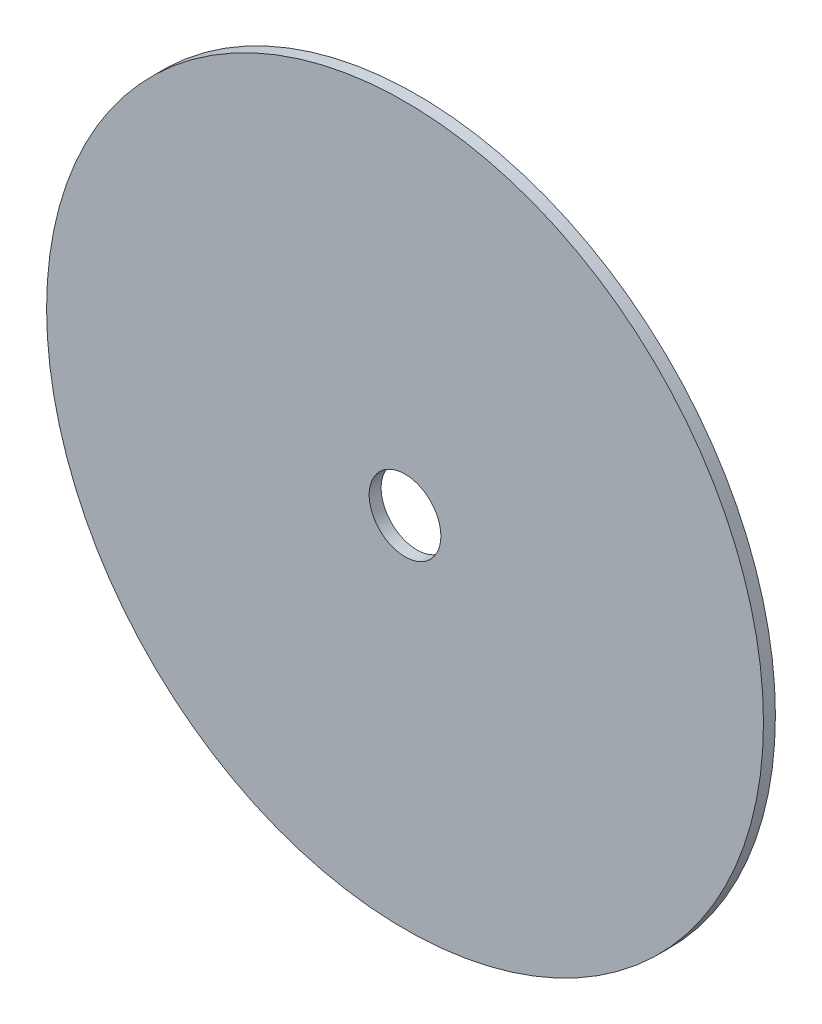
ISO-10303-21;
HEADER;
FILE_DESCRIPTION(('STEP AP214'),'2;1');
FILE_NAME('part.step','',(''),(''),'','','');
FILE_SCHEMA(('AUTOMOTIVE_DESIGN { 1 0 10303 214 1 1 1 1 }'));
ENDSEC;
DATA;
#1=APPLICATION_CONTEXT('core data for automotive mechanical design processes');
#2=APPLICATION_PROTOCOL_DEFINITION('international standard','automotive_design',2000,#1);
#3=PRODUCT_CONTEXT('',#1,'mechanical');
#4=PRODUCT('Part','Part','',(#3));
#5=PRODUCT_RELATED_PRODUCT_CATEGORY('part','',(#4));
#6=PRODUCT_DEFINITION_FORMATION('','',#4);
#7=PRODUCT_DEFINITION_CONTEXT('part definition',#1,'design');
#8=PRODUCT_DEFINITION('design','',#6,#7);
#9=PRODUCT_DEFINITION_SHAPE('','',#8);
#10=(LENGTH_UNIT() NAMED_UNIT(*) SI_UNIT(.MILLI.,.METRE.));
#11=(NAMED_UNIT(*) PLANE_ANGLE_UNIT() SI_UNIT($,.RADIAN.));
#12=(NAMED_UNIT(*) SI_UNIT($,.STERADIAN.) SOLID_ANGLE_UNIT());
#13=UNCERTAINTY_MEASURE_WITH_UNIT(LENGTH_MEASURE(1.E-05),#10,'distance_accuracy_value','');
#14=(GEOMETRIC_REPRESENTATION_CONTEXT(3) GLOBAL_UNCERTAINTY_ASSIGNED_CONTEXT((#13)) GLOBAL_UNIT_ASSIGNED_CONTEXT((#10,
#11,#12)) REPRESENTATION_CONTEXT('',''));
#15=CARTESIAN_POINT('',(0.,0.,0.));
#16=DIRECTION('',(0.,0.,1.));
#17=DIRECTION('',(1.,0.,0.));
#18=AXIS2_PLACEMENT_3D('',#15,#16,#17);
#19=CARTESIAN_POINT('',(0.,0.,0.5));
#20=DIRECTION('',(0.,0.,-1.));
#21=DIRECTION('',(-1.,0.,0.));
#22=AXIS2_PLACEMENT_3D('',#19,#20,#21);
#23=CYLINDRICAL_SURFACE('',#22,1.5);
#24=CARTESIAN_POINT('',(0.,0.,0.5));
#25=DIRECTION('',(0.,0.,1.));
#26=DIRECTION('',(1.,0.,0.));
#27=AXIS2_PLACEMENT_3D('',#24,#25,#26);
#28=CIRCLE('',#27,1.5);
#29=CARTESIAN_POINT('',(1.5,0.,0.5));
#30=VERTEX_POINT('',#29);
#31=EDGE_CURVE('E41',#30,#30,#28,.T.);
#32=ORIENTED_EDGE('',*,*,#31,.T.);
#33=EDGE_LOOP('',(#32));
#34=FACE_BOUND('',#33,.T.);
#35=CARTESIAN_POINT('',(0.,0.,0.));
#36=DIRECTION('',(0.,0.,1.));
#37=DIRECTION('',(1.,0.,0.));
#38=AXIS2_PLACEMENT_3D('',#35,#36,#37);
#39=CIRCLE('',#38,1.5);
#40=CARTESIAN_POINT('',(1.5,0.,0.));
#41=VERTEX_POINT('',#40);
#42=EDGE_CURVE('E47',#41,#41,#39,.T.);
#43=ORIENTED_EDGE('',*,*,#42,.F.);
#44=EDGE_LOOP('',(#43));
#45=FACE_BOUND('',#44,.T.);
#46=ADVANCED_FACE('F34',(#34,#45),#23,.F.);
#47=CARTESIAN_POINT('',(0.,0.,0.5));
#48=DIRECTION('',(0.,0.,-1.));
#49=DIRECTION('',(-1.,0.,0.));
#50=AXIS2_PLACEMENT_3D('',#47,#48,#49);
#51=CYLINDRICAL_SURFACE('',#50,15.);
#52=CARTESIAN_POINT('',(0.,0.,0.5));
#53=DIRECTION('',(0.,0.,1.));
#54=DIRECTION('',(1.,0.,0.));
#55=AXIS2_PLACEMENT_3D('',#52,#53,#54);
#56=CIRCLE('',#55,15.);
#57=CARTESIAN_POINT('',(15.,0.,0.5));
#58=VERTEX_POINT('',#57);
#59=EDGE_CURVE('E10',#58,#58,#56,.T.);
#60=ORIENTED_EDGE('',*,*,#59,.F.);
#61=EDGE_LOOP('',(#60));
#62=FACE_BOUND('',#61,.T.);
#63=CARTESIAN_POINT('',(0.,0.,0.));
#64=DIRECTION('',(0.,0.,1.));
#65=DIRECTION('',(1.,0.,0.));
#66=AXIS2_PLACEMENT_3D('',#63,#64,#65);
#67=CIRCLE('',#66,15.);
#68=CARTESIAN_POINT('',(15.,0.,0.));
#69=VERTEX_POINT('',#68);
#70=EDGE_CURVE('E37',#69,#69,#67,.T.);
#71=ORIENTED_EDGE('',*,*,#70,.T.);
#72=EDGE_LOOP('',(#71));
#73=FACE_BOUND('',#72,.T.);
#74=ADVANCED_FACE('F54',(#62,#73),#51,.T.);
#75=CARTESIAN_POINT('',(0.,0.,0.5));
#76=DIRECTION('',(0.,0.,1.));
#77=DIRECTION('',(1.,0.,0.));
#78=AXIS2_PLACEMENT_3D('',#75,#76,#77);
#79=PLANE('',#78);
#80=ORIENTED_EDGE('',*,*,#31,.F.);
#81=EDGE_LOOP('',(#80));
#82=FACE_BOUND('',#81,.T.);
#83=ORIENTED_EDGE('',*,*,#59,.T.);
#84=EDGE_LOOP('',(#83));
#85=FACE_BOUND('',#84,.T.);
#86=ADVANCED_FACE('F58',(#82,#85),#79,.T.);
#87=CARTESIAN_POINT('',(0.,0.,0.));
#88=DIRECTION('',(0.,0.,1.));
#89=DIRECTION('',(1.,0.,0.));
#90=AXIS2_PLACEMENT_3D('',#87,#88,#89);
#91=PLANE('',#90);
#92=ORIENTED_EDGE('',*,*,#42,.T.);
#93=EDGE_LOOP('',(#92));
#94=FACE_BOUND('',#93,.T.);
#95=ORIENTED_EDGE('',*,*,#70,.F.);
#96=EDGE_LOOP('',(#95));
#97=FACE_BOUND('',#96,.T.);
#98=ADVANCED_FACE('F56',(#94,#97),#91,.F.);
#99=CLOSED_SHELL('',(#46,#74,#86,#98));
#100=MANIFOLD_SOLID_BREP('B2',#99);
#101=ADVANCED_BREP_SHAPE_REPRESENTATION('',(#18,#100),#14);
#102=SHAPE_DEFINITION_REPRESENTATION(#9,#101);
ENDSEC;
END-ISO-10303-21;
